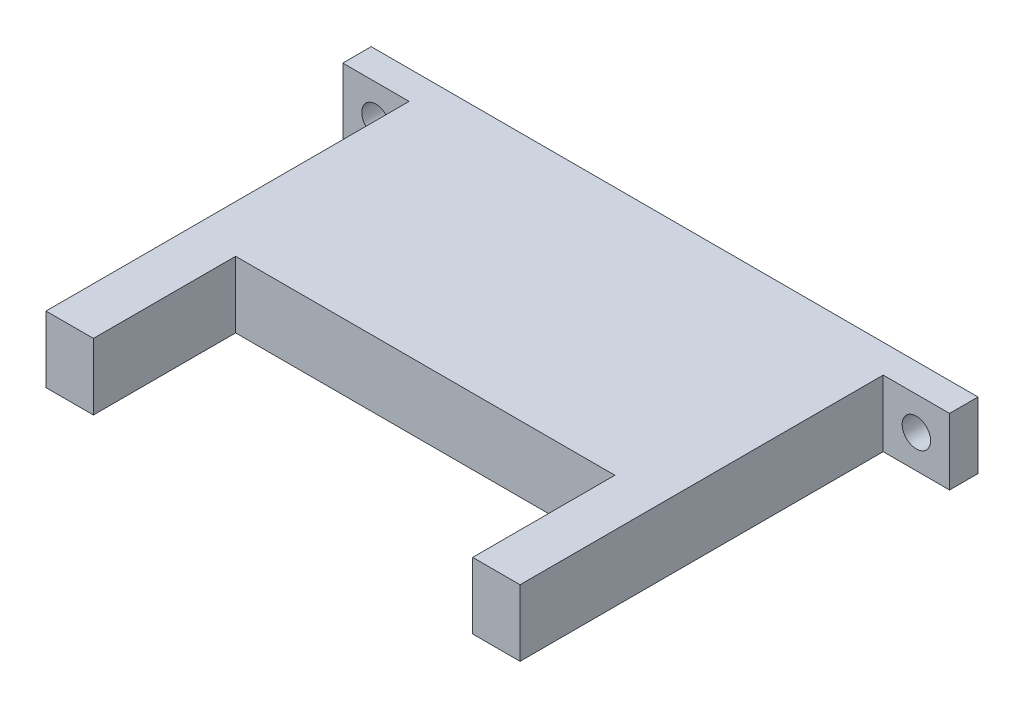
ISO-10303-21;
HEADER;
FILE_DESCRIPTION(('STEP AP214'),'2;1');
FILE_NAME('part.step','',(''),(''),'','','');
FILE_SCHEMA(('AUTOMOTIVE_DESIGN { 1 0 10303 214 1 1 1 1 }'));
ENDSEC;
DATA;
#1=APPLICATION_CONTEXT('core data for automotive mechanical design processes');
#2=APPLICATION_PROTOCOL_DEFINITION('international standard','automotive_design',2000,#1);
#3=PRODUCT_CONTEXT('',#1,'mechanical');
#4=PRODUCT('Part','Part','',(#3));
#5=PRODUCT_RELATED_PRODUCT_CATEGORY('part','',(#4));
#6=PRODUCT_DEFINITION_FORMATION('','',#4);
#7=PRODUCT_DEFINITION_CONTEXT('part definition',#1,'design');
#8=PRODUCT_DEFINITION('design','',#6,#7);
#9=PRODUCT_DEFINITION_SHAPE('','',#8);
#10=(LENGTH_UNIT() NAMED_UNIT(*) SI_UNIT(.MILLI.,.METRE.));
#11=(NAMED_UNIT(*) PLANE_ANGLE_UNIT() SI_UNIT($,.RADIAN.));
#12=(NAMED_UNIT(*) SI_UNIT($,.STERADIAN.) SOLID_ANGLE_UNIT());
#13=UNCERTAINTY_MEASURE_WITH_UNIT(LENGTH_MEASURE(1.E-05),#10,'distance_accuracy_value','');
#14=(GEOMETRIC_REPRESENTATION_CONTEXT(3) GLOBAL_UNCERTAINTY_ASSIGNED_CONTEXT((#13)) GLOBAL_UNIT_ASSIGNED_CONTEXT((#10,
#11,#12)) REPRESENTATION_CONTEXT('',''));
#15=CARTESIAN_POINT('',(0.,0.,0.));
#16=DIRECTION('',(0.,0.,1.));
#17=DIRECTION('',(1.,0.,0.));
#18=AXIS2_PLACEMENT_3D('',#15,#16,#17);
#19=CARTESIAN_POINT('',(0.,0.,26.3));
#20=DIRECTION('',(0.,0.,1.));
#21=DIRECTION('',(1.,0.,0.));
#22=AXIS2_PLACEMENT_3D('',#19,#20,#21);
#23=PLANE('',#22);
#24=DIRECTION('',(1.,0.,0.));
#25=VECTOR('',#24,1.);
#26=CARTESIAN_POINT('',(-25.,-3.5,26.3));
#27=LINE('',#26,#25);
#28=CARTESIAN_POINT('',(-20.,-3.5,26.3));
#29=VERTEX_POINT('',#28);
#30=CARTESIAN_POINT('',(20.,-3.5,26.3));
#31=VERTEX_POINT('',#30);
#32=EDGE_CURVE('E53',#29,#31,#27,.T.);
#33=ORIENTED_EDGE('',*,*,#32,.T.);
#34=DIRECTION('',(0.,-1.,0.));
#35=VECTOR('',#34,1.);
#36=CARTESIAN_POINT('',(20.,-3.5,26.3));
#37=LINE('',#36,#35);
#38=CARTESIAN_POINT('',(20.,3.5,26.3));
#39=VERTEX_POINT('',#38);
#40=EDGE_CURVE('E48',#39,#31,#37,.T.);
#41=ORIENTED_EDGE('',*,*,#40,.F.);
#42=DIRECTION('',(-1.,0.,0.));
#43=VECTOR('',#42,1.);
#44=CARTESIAN_POINT('',(-25.,3.5,26.3));
#45=LINE('',#44,#43);
#46=CARTESIAN_POINT('',(-20.,3.5,26.3));
#47=VERTEX_POINT('',#46);
#48=EDGE_CURVE('E179',#39,#47,#45,.T.);
#49=ORIENTED_EDGE('',*,*,#48,.T.);
#50=DIRECTION('',(0.,1.,0.));
#51=VECTOR('',#50,1.);
#52=CARTESIAN_POINT('',(-20.,-3.5,26.3));
#53=LINE('',#52,#51);
#54=EDGE_CURVE('E158',#29,#47,#53,.T.);
#55=ORIENTED_EDGE('',*,*,#54,.F.);
#56=EDGE_LOOP('',(#33,#41,#49,#55));
#57=FACE_BOUND('',#56,.T.);
#58=ADVANCED_FACE('F33',(#57),#23,.T.);
#59=CARTESIAN_POINT('',(0.,0.,3.));
#60=DIRECTION('',(0.,0.,1.));
#61=DIRECTION('',(1.,0.,0.));
#62=AXIS2_PLACEMENT_3D('',#59,#60,#61);
#63=PLANE('',#62);
#64=CARTESIAN_POINT('',(-28.5,0.,3.));
#65=DIRECTION('',(0.,0.,1.));
#66=DIRECTION('',(1.,0.,0.));
#67=AXIS2_PLACEMENT_3D('',#64,#65,#66);
#68=CIRCLE('',#67,1.5);
#69=CARTESIAN_POINT('',(-27.,0.,3.));
#70=VERTEX_POINT('',#69);
#71=EDGE_CURVE('E149',#70,#70,#68,.T.);
#72=ORIENTED_EDGE('',*,*,#71,.F.);
#73=EDGE_LOOP('',(#72));
#74=FACE_BOUND('',#73,.T.);
#75=DIRECTION('',(0.,-1.,0.));
#76=VECTOR('',#75,1.);
#77=CARTESIAN_POINT('',(-25.,3.5,3.));
#78=LINE('',#77,#76);
#79=CARTESIAN_POINT('',(-25.,3.5,3.));
#80=VERTEX_POINT('',#79);
#81=CARTESIAN_POINT('',(-25.,-3.5,3.));
#82=VERTEX_POINT('',#81);
#83=EDGE_CURVE('E177',#80,#82,#78,.T.);
#84=ORIENTED_EDGE('',*,*,#83,.F.);
#85=DIRECTION('',(-1.,0.,0.));
#86=VECTOR('',#85,1.);
#87=CARTESIAN_POINT('',(-32.,3.5,3.));
#88=LINE('',#87,#86);
#89=CARTESIAN_POINT('',(-32.,3.5,3.));
#90=VERTEX_POINT('',#89);
#91=EDGE_CURVE('E194',#80,#90,#88,.T.);
#92=ORIENTED_EDGE('',*,*,#91,.T.);
#93=DIRECTION('',(0.,-1.,0.));
#94=VECTOR('',#93,1.);
#95=CARTESIAN_POINT('',(-32.,3.5,3.));
#96=LINE('',#95,#94);
#97=CARTESIAN_POINT('',(-32.,-3.5,3.));
#98=VERTEX_POINT('',#97);
#99=EDGE_CURVE('E198',#90,#98,#96,.T.);
#100=ORIENTED_EDGE('',*,*,#99,.T.);
#101=DIRECTION('',(1.,0.,0.));
#102=VECTOR('',#101,1.);
#103=CARTESIAN_POINT('',(-32.,-3.5,3.));
#104=LINE('',#103,#102);
#105=EDGE_CURVE('E201',#98,#82,#104,.T.);
#106=ORIENTED_EDGE('',*,*,#105,.T.);
#107=EDGE_LOOP('',(#84,#92,#100,#106));
#108=FACE_BOUND('',#107,.T.);
#109=ADVANCED_FACE('F254',(#74,#108),#63,.T.);
#110=CARTESIAN_POINT('',(32.,3.5,3.));
#111=DIRECTION('',(-1.,0.,0.));
#112=DIRECTION('',(0.,0.,1.));
#113=AXIS2_PLACEMENT_3D('',#110,#111,#112);
#114=PLANE('',#113);
#115=DIRECTION('',(0.,1.,0.));
#116=VECTOR('',#115,1.);
#117=CARTESIAN_POINT('',(32.,3.5,0.));
#118=LINE('',#117,#116);
#119=CARTESIAN_POINT('',(32.,-3.5,0.));
#120=VERTEX_POINT('',#119);
#121=CARTESIAN_POINT('',(32.,3.5,0.));
#122=VERTEX_POINT('',#121);
#123=EDGE_CURVE('E190',#120,#122,#118,.T.);
#124=ORIENTED_EDGE('',*,*,#123,.T.);
#125=DIRECTION('',(0.,0.,-1.));
#126=VECTOR('',#125,1.);
#127=CARTESIAN_POINT('',(32.,3.5,3.));
#128=LINE('',#127,#126);
#129=CARTESIAN_POINT('',(32.,3.5,3.));
#130=VERTEX_POINT('',#129);
#131=EDGE_CURVE('E11',#130,#122,#128,.T.);
#132=ORIENTED_EDGE('',*,*,#131,.F.);
#133=DIRECTION('',(0.,1.,0.));
#134=VECTOR('',#133,1.);
#135=CARTESIAN_POINT('',(32.,3.5,3.));
#136=LINE('',#135,#134);
#137=CARTESIAN_POINT('',(32.,-3.5,3.));
#138=VERTEX_POINT('',#137);
#139=EDGE_CURVE('E191',#138,#130,#136,.T.);
#140=ORIENTED_EDGE('',*,*,#139,.F.);
#141=DIRECTION('',(0.,0.,-1.));
#142=VECTOR('',#141,1.);
#143=CARTESIAN_POINT('',(32.,-3.5,3.));
#144=LINE('',#143,#142);
#145=EDGE_CURVE('E203',#138,#120,#144,.T.);
#146=ORIENTED_EDGE('',*,*,#145,.T.);
#147=EDGE_LOOP('',(#124,#132,#140,#146));
#148=FACE_BOUND('',#147,.T.);
#149=ADVANCED_FACE('F35',(#148),#114,.F.);
#150=CARTESIAN_POINT('',(-32.,3.5,3.));
#151=DIRECTION('',(0.,-1.,0.));
#152=DIRECTION('',(0.,0.,-1.));
#153=AXIS2_PLACEMENT_3D('',#150,#151,#152);
#154=PLANE('',#153);
#155=DIRECTION('',(-1.,0.,0.));
#156=VECTOR('',#155,1.);
#157=CARTESIAN_POINT('',(-32.,3.5,0.));
#158=LINE('',#157,#156);
#159=CARTESIAN_POINT('',(-32.,3.5,0.));
#160=VERTEX_POINT('',#159);
#161=EDGE_CURVE('E206',#122,#160,#158,.T.);
#162=ORIENTED_EDGE('',*,*,#161,.T.);
#163=DIRECTION('',(0.,0.,-1.));
#164=VECTOR('',#163,1.);
#165=CARTESIAN_POINT('',(-32.,3.5,3.));
#166=LINE('',#165,#164);
#167=EDGE_CURVE('E41',#90,#160,#166,.T.);
#168=ORIENTED_EDGE('',*,*,#167,.F.);
#169=ORIENTED_EDGE('',*,*,#91,.F.);
#170=DIRECTION('',(0.,0.,-1.));
#171=VECTOR('',#170,1.);
#172=CARTESIAN_POINT('',(-25.,3.5,26.3));
#173=LINE('',#172,#171);
#174=CARTESIAN_POINT('',(-25.,3.5,41.3));
#175=VERTEX_POINT('',#174);
#176=EDGE_CURVE('E130',#175,#80,#173,.T.);
#177=ORIENTED_EDGE('',*,*,#176,.F.);
#178=DIRECTION('',(-1.,0.,0.));
#179=VECTOR('',#178,1.);
#180=CARTESIAN_POINT('',(-25.,3.5,41.3));
#181=LINE('',#180,#179);
#182=CARTESIAN_POINT('',(-20.,3.5,41.3));
#183=VERTEX_POINT('',#182);
#184=EDGE_CURVE('E166',#183,#175,#181,.T.);
#185=ORIENTED_EDGE('',*,*,#184,.F.);
#186=DIRECTION('',(0.,0.,-1.));
#187=VECTOR('',#186,1.);
#188=CARTESIAN_POINT('',(-20.,3.5,41.3));
#189=LINE('',#188,#187);
#190=EDGE_CURVE('E169',#183,#47,#189,.T.);
#191=ORIENTED_EDGE('',*,*,#190,.T.);
#192=ORIENTED_EDGE('',*,*,#48,.F.);
#193=DIRECTION('',(0.,0.,-1.));
#194=VECTOR('',#193,1.);
#195=CARTESIAN_POINT('',(20.,3.5,41.3));
#196=LINE('',#195,#194);
#197=CARTESIAN_POINT('',(20.,3.5,41.3));
#198=VERTEX_POINT('',#197);
#199=EDGE_CURVE('E136',#198,#39,#196,.T.);
#200=ORIENTED_EDGE('',*,*,#199,.F.);
#201=DIRECTION('',(-1.,0.,0.));
#202=VECTOR('',#201,1.);
#203=CARTESIAN_POINT('',(25.,3.5,41.3));
#204=LINE('',#203,#202);
#205=CARTESIAN_POINT('',(25.,3.5,41.3));
#206=VERTEX_POINT('',#205);
#207=EDGE_CURVE('E133',#206,#198,#204,.T.);
#208=ORIENTED_EDGE('',*,*,#207,.F.);
#209=DIRECTION('',(0.,0.,-1.));
#210=VECTOR('',#209,1.);
#211=CARTESIAN_POINT('',(25.,3.5,26.3));
#212=LINE('',#211,#210);
#213=CARTESIAN_POINT('',(25.,3.5,3.));
#214=VERTEX_POINT('',#213);
#215=EDGE_CURVE('E121',#206,#214,#212,.T.);
#216=ORIENTED_EDGE('',*,*,#215,.T.);
#217=EDGE_CURVE('E196',#130,#214,#88,.T.);
#218=ORIENTED_EDGE('',*,*,#217,.F.);
#219=ORIENTED_EDGE('',*,*,#131,.T.);
#220=EDGE_LOOP('',(#162,#168,#169,#177,#185,#191,#192,#200,#208,#216,#218,#219));
#221=FACE_BOUND('',#220,.T.);
#222=ADVANCED_FACE('F134',(#221),#154,.F.);
#223=CARTESIAN_POINT('',(-32.,3.5,3.));
#224=DIRECTION('',(1.,0.,0.));
#225=DIRECTION('',(0.,0.,-1.));
#226=AXIS2_PLACEMENT_3D('',#223,#224,#225);
#227=PLANE('',#226);
#228=DIRECTION('',(0.,-1.,0.));
#229=VECTOR('',#228,1.);
#230=CARTESIAN_POINT('',(-32.,3.5,0.));
#231=LINE('',#230,#229);
#232=CARTESIAN_POINT('',(-32.,-3.5,0.));
#233=VERTEX_POINT('',#232);
#234=EDGE_CURVE('E208',#160,#233,#231,.T.);
#235=ORIENTED_EDGE('',*,*,#234,.T.);
#236=DIRECTION('',(0.,0.,-1.));
#237=VECTOR('',#236,1.);
#238=CARTESIAN_POINT('',(-32.,-3.5,3.));
#239=LINE('',#238,#237);
#240=EDGE_CURVE('E213',#98,#233,#239,.T.);
#241=ORIENTED_EDGE('',*,*,#240,.F.);
#242=ORIENTED_EDGE('',*,*,#99,.F.);
#243=ORIENTED_EDGE('',*,*,#167,.T.);
#244=EDGE_LOOP('',(#235,#241,#242,#243));
#245=FACE_BOUND('',#244,.T.);
#246=ADVANCED_FACE('F220',(#245),#227,.F.);
#247=CARTESIAN_POINT('',(-32.,-3.5,3.));
#248=DIRECTION('',(0.,1.,0.));
#249=DIRECTION('',(0.,0.,1.));
#250=AXIS2_PLACEMENT_3D('',#247,#248,#249);
#251=PLANE('',#250);
#252=DIRECTION('',(1.,0.,0.));
#253=VECTOR('',#252,1.);
#254=CARTESIAN_POINT('',(-32.,-3.5,0.));
#255=LINE('',#254,#253);
#256=EDGE_CURVE('E195',#233,#120,#255,.T.);
#257=ORIENTED_EDGE('',*,*,#256,.T.);
#258=ORIENTED_EDGE('',*,*,#145,.F.);
#259=CARTESIAN_POINT('',(25.,-3.5,3.));
#260=VERTEX_POINT('',#259);
#261=EDGE_CURVE('E200',#260,#138,#104,.T.);
#262=ORIENTED_EDGE('',*,*,#261,.F.);
#263=DIRECTION('',(0.,0.,-1.));
#264=VECTOR('',#263,1.);
#265=CARTESIAN_POINT('',(25.,-3.5,26.3));
#266=LINE('',#265,#264);
#267=CARTESIAN_POINT('',(25.,-3.5,41.3));
#268=VERTEX_POINT('',#267);
#269=EDGE_CURVE('E129',#268,#260,#266,.T.);
#270=ORIENTED_EDGE('',*,*,#269,.F.);
#271=DIRECTION('',(1.,0.,0.));
#272=VECTOR('',#271,1.);
#273=CARTESIAN_POINT('',(25.,-3.5,41.3));
#274=LINE('',#273,#272);
#275=CARTESIAN_POINT('',(20.,-3.5,41.3));
#276=VERTEX_POINT('',#275);
#277=EDGE_CURVE('E144',#276,#268,#274,.T.);
#278=ORIENTED_EDGE('',*,*,#277,.F.);
#279=DIRECTION('',(0.,0.,-1.));
#280=VECTOR('',#279,1.);
#281=CARTESIAN_POINT('',(20.,-3.5,41.3));
#282=LINE('',#281,#280);
#283=EDGE_CURVE('E153',#276,#31,#282,.T.);
#284=ORIENTED_EDGE('',*,*,#283,.T.);
#285=ORIENTED_EDGE('',*,*,#32,.F.);
#286=DIRECTION('',(0.,0.,-1.));
#287=VECTOR('',#286,1.);
#288=CARTESIAN_POINT('',(-20.,-3.5,41.3));
#289=LINE('',#288,#287);
#290=CARTESIAN_POINT('',(-20.,-3.5,41.3));
#291=VERTEX_POINT('',#290);
#292=EDGE_CURVE('E174',#291,#29,#289,.T.);
#293=ORIENTED_EDGE('',*,*,#292,.F.);
#294=DIRECTION('',(1.,0.,0.));
#295=VECTOR('',#294,1.);
#296=CARTESIAN_POINT('',(-25.,-3.5,41.3));
#297=LINE('',#296,#295);
#298=CARTESIAN_POINT('',(-25.,-3.5,41.3));
#299=VERTEX_POINT('',#298);
#300=EDGE_CURVE('E162',#299,#291,#297,.T.);
#301=ORIENTED_EDGE('',*,*,#300,.F.);
#302=DIRECTION('',(0.,0.,-1.));
#303=VECTOR('',#302,1.);
#304=CARTESIAN_POINT('',(-25.,-3.5,26.3));
#305=LINE('',#304,#303);
#306=EDGE_CURVE('E187',#299,#82,#305,.T.);
#307=ORIENTED_EDGE('',*,*,#306,.T.);
#308=ORIENTED_EDGE('',*,*,#105,.F.);
#309=ORIENTED_EDGE('',*,*,#240,.T.);
#310=EDGE_LOOP('',(#257,#258,#262,#270,#278,#284,#285,#293,#301,#307,#308,#309));
#311=FACE_BOUND('',#310,.T.);
#312=ADVANCED_FACE('F229',(#311),#251,.F.);
#313=CARTESIAN_POINT('',(28.5,0.,3.));
#314=DIRECTION('',(0.,0.,1.));
#315=DIRECTION('',(1.,0.,0.));
#316=AXIS2_PLACEMENT_3D('',#313,#314,#315);
#317=CIRCLE('',#316,1.5);
#318=CARTESIAN_POINT('',(30.,0.,3.));
#319=VERTEX_POINT('',#318);
#320=EDGE_CURVE('E334',#319,#319,#317,.T.);
#321=ORIENTED_EDGE('',*,*,#320,.F.);
#322=EDGE_LOOP('',(#321));
#323=FACE_BOUND('',#322,.T.);
#324=DIRECTION('',(0.,1.,0.));
#325=VECTOR('',#324,1.);
#326=CARTESIAN_POINT('',(25.,3.5,3.));
#327=LINE('',#326,#325);
#328=EDGE_CURVE('E127',#260,#214,#327,.T.);
#329=ORIENTED_EDGE('',*,*,#328,.F.);
#330=ORIENTED_EDGE('',*,*,#261,.T.);
#331=ORIENTED_EDGE('',*,*,#139,.T.);
#332=ORIENTED_EDGE('',*,*,#217,.T.);
#333=EDGE_LOOP('',(#329,#330,#331,#332));
#334=FACE_BOUND('',#333,.T.);
#335=ADVANCED_FACE('F236',(#323,#334),#63,.T.);
#336=CARTESIAN_POINT('',(0.,0.,0.));
#337=DIRECTION('',(0.,0.,1.));
#338=DIRECTION('',(1.,0.,0.));
#339=AXIS2_PLACEMENT_3D('',#336,#337,#338);
#340=PLANE('',#339);
#341=CARTESIAN_POINT('',(28.5,0.,0.));
#342=DIRECTION('',(0.,0.,1.));
#343=DIRECTION('',(1.,0.,0.));
#344=AXIS2_PLACEMENT_3D('',#341,#342,#343);
#345=CIRCLE('',#344,1.5);
#346=CARTESIAN_POINT('',(30.,0.,0.));
#347=VERTEX_POINT('',#346);
#348=EDGE_CURVE('E331',#347,#347,#345,.T.);
#349=ORIENTED_EDGE('',*,*,#348,.T.);
#350=EDGE_LOOP('',(#349));
#351=FACE_BOUND('',#350,.T.);
#352=CARTESIAN_POINT('',(-28.5,0.,0.));
#353=DIRECTION('',(0.,0.,1.));
#354=DIRECTION('',(1.,0.,0.));
#355=AXIS2_PLACEMENT_3D('',#352,#353,#354);
#356=CIRCLE('',#355,1.5);
#357=CARTESIAN_POINT('',(-27.,0.,0.));
#358=VERTEX_POINT('',#357);
#359=EDGE_CURVE('E146',#358,#358,#356,.T.);
#360=ORIENTED_EDGE('',*,*,#359,.T.);
#361=EDGE_LOOP('',(#360));
#362=FACE_BOUND('',#361,.T.);
#363=ORIENTED_EDGE('',*,*,#123,.F.);
#364=ORIENTED_EDGE('',*,*,#256,.F.);
#365=ORIENTED_EDGE('',*,*,#234,.F.);
#366=ORIENTED_EDGE('',*,*,#161,.F.);
#367=EDGE_LOOP('',(#363,#364,#365,#366));
#368=FACE_BOUND('',#367,.T.);
#369=ADVANCED_FACE('F226',(#351,#362,#368),#340,.F.);
#370=CARTESIAN_POINT('',(-25.,3.5,26.3));
#371=DIRECTION('',(1.,0.,0.));
#372=DIRECTION('',(0.,0.,-1.));
#373=AXIS2_PLACEMENT_3D('',#370,#371,#372);
#374=PLANE('',#373);
#375=ORIENTED_EDGE('',*,*,#83,.T.);
#376=ORIENTED_EDGE('',*,*,#306,.F.);
#377=DIRECTION('',(0.,-1.,0.));
#378=VECTOR('',#377,1.);
#379=CARTESIAN_POINT('',(-25.,-3.5,41.3));
#380=LINE('',#379,#378);
#381=EDGE_CURVE('E159',#175,#299,#380,.T.);
#382=ORIENTED_EDGE('',*,*,#381,.F.);
#383=ORIENTED_EDGE('',*,*,#176,.T.);
#384=EDGE_LOOP('',(#375,#376,#382,#383));
#385=FACE_BOUND('',#384,.T.);
#386=ADVANCED_FACE('F265',(#385),#374,.F.);
#387=CARTESIAN_POINT('',(25.,3.5,26.3));
#388=DIRECTION('',(-1.,0.,0.));
#389=DIRECTION('',(0.,0.,1.));
#390=AXIS2_PLACEMENT_3D('',#387,#388,#389);
#391=PLANE('',#390);
#392=ORIENTED_EDGE('',*,*,#328,.T.);
#393=ORIENTED_EDGE('',*,*,#215,.F.);
#394=DIRECTION('',(0.,1.,0.));
#395=VECTOR('',#394,1.);
#396=CARTESIAN_POINT('',(25.,-3.5,41.3));
#397=LINE('',#396,#395);
#398=EDGE_CURVE('E126',#268,#206,#397,.T.);
#399=ORIENTED_EDGE('',*,*,#398,.F.);
#400=ORIENTED_EDGE('',*,*,#269,.T.);
#401=EDGE_LOOP('',(#392,#393,#399,#400));
#402=FACE_BOUND('',#401,.T.);
#403=ADVANCED_FACE('F123',(#402),#391,.F.);
#404=CARTESIAN_POINT('',(-20.,-3.5,41.3));
#405=DIRECTION('',(-1.,0.,0.));
#406=DIRECTION('',(0.,-1.,0.));
#407=AXIS2_PLACEMENT_3D('',#404,#405,#406);
#408=PLANE('',#407);
#409=ORIENTED_EDGE('',*,*,#54,.T.);
#410=ORIENTED_EDGE('',*,*,#190,.F.);
#411=DIRECTION('',(0.,1.,0.));
#412=VECTOR('',#411,1.);
#413=CARTESIAN_POINT('',(-20.,-3.5,41.3));
#414=LINE('',#413,#412);
#415=EDGE_CURVE('E164',#291,#183,#414,.T.);
#416=ORIENTED_EDGE('',*,*,#415,.F.);
#417=ORIENTED_EDGE('',*,*,#292,.T.);
#418=EDGE_LOOP('',(#409,#410,#416,#417));
#419=FACE_BOUND('',#418,.T.);
#420=ADVANCED_FACE('F250',(#419),#408,.F.);
#421=CARTESIAN_POINT('',(0.,0.,41.3));
#422=DIRECTION('',(0.,0.,-1.));
#423=DIRECTION('',(-1.,0.,0.));
#424=AXIS2_PLACEMENT_3D('',#421,#422,#423);
#425=PLANE('',#424);
#426=ORIENTED_EDGE('',*,*,#381,.T.);
#427=ORIENTED_EDGE('',*,*,#300,.T.);
#428=ORIENTED_EDGE('',*,*,#415,.T.);
#429=ORIENTED_EDGE('',*,*,#184,.T.);
#430=EDGE_LOOP('',(#426,#427,#428,#429));
#431=FACE_BOUND('',#430,.T.);
#432=ADVANCED_FACE('F242',(#431),#425,.F.);
#433=CARTESIAN_POINT('',(20.,-3.5,41.3));
#434=DIRECTION('',(1.,0.,0.));
#435=DIRECTION('',(0.,0.,-1.));
#436=AXIS2_PLACEMENT_3D('',#433,#434,#435);
#437=PLANE('',#436);
#438=ORIENTED_EDGE('',*,*,#40,.T.);
#439=ORIENTED_EDGE('',*,*,#283,.F.);
#440=DIRECTION('',(0.,-1.,0.));
#441=VECTOR('',#440,1.);
#442=CARTESIAN_POINT('',(20.,-3.5,41.3));
#443=LINE('',#442,#441);
#444=EDGE_CURVE('E139',#198,#276,#443,.T.);
#445=ORIENTED_EDGE('',*,*,#444,.F.);
#446=ORIENTED_EDGE('',*,*,#199,.T.);
#447=EDGE_LOOP('',(#438,#439,#445,#446));
#448=FACE_BOUND('',#447,.T.);
#449=ADVANCED_FACE('F240',(#448),#437,.F.);
#450=CARTESIAN_POINT('',(0.,0.,41.3));
#451=DIRECTION('',(0.,0.,1.));
#452=DIRECTION('',(1.,0.,0.));
#453=AXIS2_PLACEMENT_3D('',#450,#451,#452);
#454=PLANE('',#453);
#455=ORIENTED_EDGE('',*,*,#398,.T.);
#456=ORIENTED_EDGE('',*,*,#207,.T.);
#457=ORIENTED_EDGE('',*,*,#444,.T.);
#458=ORIENTED_EDGE('',*,*,#277,.T.);
#459=EDGE_LOOP('',(#455,#456,#457,#458));
#460=FACE_BOUND('',#459,.T.);
#461=ADVANCED_FACE('F142',(#460),#454,.T.);
#462=CARTESIAN_POINT('',(-28.5,0.,0.));
#463=DIRECTION('',(0.,0.,1.));
#464=DIRECTION('',(1.,0.,0.));
#465=AXIS2_PLACEMENT_3D('',#462,#463,#464);
#466=CYLINDRICAL_SURFACE('',#465,1.5);
#467=ORIENTED_EDGE('',*,*,#359,.F.);
#468=EDGE_LOOP('',(#467));
#469=FACE_BOUND('',#468,.T.);
#470=ORIENTED_EDGE('',*,*,#71,.T.);
#471=EDGE_LOOP('',(#470));
#472=FACE_BOUND('',#471,.T.);
#473=ADVANCED_FACE('F248',(#469,#472),#466,.F.);
#474=CARTESIAN_POINT('',(28.5,0.,0.));
#475=DIRECTION('',(0.,0.,1.));
#476=DIRECTION('',(1.,0.,0.));
#477=AXIS2_PLACEMENT_3D('',#474,#475,#476);
#478=CYLINDRICAL_SURFACE('',#477,1.5);
#479=ORIENTED_EDGE('',*,*,#348,.F.);
#480=EDGE_LOOP('',(#479));
#481=FACE_BOUND('',#480,.T.);
#482=ORIENTED_EDGE('',*,*,#320,.T.);
#483=EDGE_LOOP('',(#482));
#484=FACE_BOUND('',#483,.T.);
#485=ADVANCED_FACE('F302',(#481,#484),#478,.F.);
#486=CLOSED_SHELL('',(#58,#109,#149,#222,#246,#312,#335,#369,#386,#403,#420,#432,#449,#461,#473,#485));
#487=MANIFOLD_SOLID_BREP('B2',#486);
#488=ADVANCED_BREP_SHAPE_REPRESENTATION('',(#18,#487),#14);
#489=SHAPE_DEFINITION_REPRESENTATION(#9,#488);
ENDSEC;
END-ISO-10303-21;
